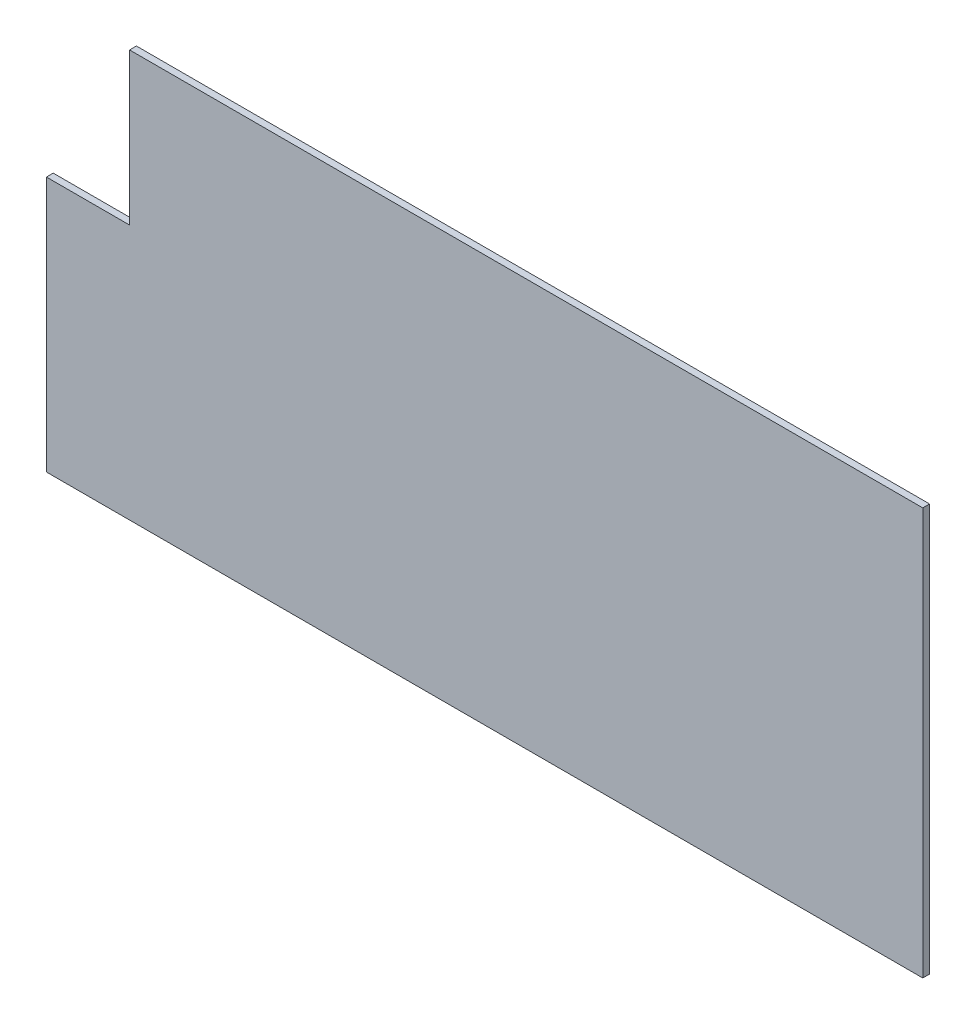
ISO-10303-21;
HEADER;
FILE_DESCRIPTION(('STEP AP214'),'2;1');
FILE_NAME('part.step','',(''),(''),'','','');
FILE_SCHEMA(('AUTOMOTIVE_DESIGN { 1 0 10303 214 1 1 1 1 }'));
ENDSEC;
DATA;
#1=APPLICATION_CONTEXT('core data for automotive mechanical design processes');
#2=APPLICATION_PROTOCOL_DEFINITION('international standard','automotive_design',2000,#1);
#3=PRODUCT_CONTEXT('',#1,'mechanical');
#4=PRODUCT('Part','Part','',(#3));
#5=PRODUCT_RELATED_PRODUCT_CATEGORY('part','',(#4));
#6=PRODUCT_DEFINITION_FORMATION('','',#4);
#7=PRODUCT_DEFINITION_CONTEXT('part definition',#1,'design');
#8=PRODUCT_DEFINITION('design','',#6,#7);
#9=PRODUCT_DEFINITION_SHAPE('','',#8);
#10=(LENGTH_UNIT() NAMED_UNIT(*) SI_UNIT(.MILLI.,.METRE.));
#11=(NAMED_UNIT(*) PLANE_ANGLE_UNIT() SI_UNIT($,.RADIAN.));
#12=(NAMED_UNIT(*) SI_UNIT($,.STERADIAN.) SOLID_ANGLE_UNIT());
#13=UNCERTAINTY_MEASURE_WITH_UNIT(LENGTH_MEASURE(1.E-05),#10,'distance_accuracy_value','');
#14=(GEOMETRIC_REPRESENTATION_CONTEXT(3) GLOBAL_UNCERTAINTY_ASSIGNED_CONTEXT((#13)) GLOBAL_UNIT_ASSIGNED_CONTEXT((#10,
#11,#12)) REPRESENTATION_CONTEXT('',''));
#15=CARTESIAN_POINT('',(0.,0.,0.));
#16=DIRECTION('',(0.,0.,1.));
#17=DIRECTION('',(1.,0.,0.));
#18=AXIS2_PLACEMENT_3D('',#15,#16,#17);
#19=CARTESIAN_POINT('',(289.5,-134.5,2.2479));
#20=DIRECTION('',(-1.,0.,0.));
#21=DIRECTION('',(0.,0.,1.));
#22=AXIS2_PLACEMENT_3D('',#19,#20,#21);
#23=PLANE('',#22);
#24=DIRECTION('',(0.,1.,0.));
#25=VECTOR('',#24,1.);
#26=CARTESIAN_POINT('',(289.5,-134.5,-2.2479));
#27=LINE('',#26,#25);
#28=CARTESIAN_POINT('',(289.5,-134.5,-2.2479));
#29=VERTEX_POINT('',#28);
#30=CARTESIAN_POINT('',(289.5,134.5,-2.2479));
#31=VERTEX_POINT('',#30);
#32=EDGE_CURVE('E119',#29,#31,#27,.T.);
#33=ORIENTED_EDGE('',*,*,#32,.T.);
#34=DIRECTION('',(0.,0.,-1.));
#35=VECTOR('',#34,1.);
#36=CARTESIAN_POINT('',(289.5,134.5,2.2479));
#37=LINE('',#36,#35);
#38=CARTESIAN_POINT('',(289.5,134.5,2.2479));
#39=VERTEX_POINT('',#38);
#40=EDGE_CURVE('E11',#39,#31,#37,.T.);
#41=ORIENTED_EDGE('',*,*,#40,.F.);
#42=DIRECTION('',(0.,1.,0.));
#43=VECTOR('',#42,1.);
#44=CARTESIAN_POINT('',(289.5,-134.5,2.2479));
#45=LINE('',#44,#43);
#46=CARTESIAN_POINT('',(289.5,-134.5,2.2479));
#47=VERTEX_POINT('',#46);
#48=EDGE_CURVE('E120',#47,#39,#45,.T.);
#49=ORIENTED_EDGE('',*,*,#48,.F.);
#50=DIRECTION('',(0.,0.,-1.));
#51=VECTOR('',#50,1.);
#52=CARTESIAN_POINT('',(289.5,-134.5,2.2479));
#53=LINE('',#52,#51);
#54=EDGE_CURVE('E126',#47,#29,#53,.T.);
#55=ORIENTED_EDGE('',*,*,#54,.T.);
#56=EDGE_LOOP('',(#33,#41,#49,#55));
#57=FACE_BOUND('',#56,.T.);
#58=ADVANCED_FACE('F33',(#57),#23,.F.);
#59=CARTESIAN_POINT('',(-289.5,134.5,2.2479));
#60=DIRECTION('',(0.,-1.,0.));
#61=DIRECTION('',(0.,0.,-1.));
#62=AXIS2_PLACEMENT_3D('',#59,#60,#61);
#63=PLANE('',#62);
#64=DIRECTION('',(-1.,0.,0.));
#65=VECTOR('',#64,1.);
#66=CARTESIAN_POINT('',(-289.5,134.5,-2.2479));
#67=LINE('',#66,#65);
#68=CARTESIAN_POINT('',(-234.550006437455,134.5,-2.2479));
#69=VERTEX_POINT('',#68);
#70=EDGE_CURVE('E129',#31,#69,#67,.T.);
#71=ORIENTED_EDGE('',*,*,#70,.T.);
#72=DIRECTION('',(0.,0.,-1.));
#73=VECTOR('',#72,1.);
#74=CARTESIAN_POINT('',(-234.550006437455,134.5,116.526252248025));
#75=LINE('',#74,#73);
#76=CARTESIAN_POINT('',(-234.550006437455,134.5,2.2479));
#77=VERTEX_POINT('',#76);
#78=EDGE_CURVE('E47',#77,#69,#75,.T.);
#79=ORIENTED_EDGE('',*,*,#78,.F.);
#80=DIRECTION('',(-1.,0.,0.));
#81=VECTOR('',#80,1.);
#82=CARTESIAN_POINT('',(-289.5,134.5,2.2479));
#83=LINE('',#82,#81);
#84=EDGE_CURVE('E78',#39,#77,#83,.T.);
#85=ORIENTED_EDGE('',*,*,#84,.F.);
#86=ORIENTED_EDGE('',*,*,#40,.T.);
#87=EDGE_LOOP('',(#71,#79,#85,#86));
#88=FACE_BOUND('',#87,.T.);
#89=ADVANCED_FACE('F142',(#88),#63,.F.);
#90=CARTESIAN_POINT('',(-289.5,-134.5,2.2479));
#91=DIRECTION('',(1.,0.,0.));
#92=DIRECTION('',(0.,0.,-1.));
#93=AXIS2_PLACEMENT_3D('',#90,#91,#92);
#94=PLANE('',#93);
#95=DIRECTION('',(0.,-1.,0.));
#96=VECTOR('',#95,1.);
#97=CARTESIAN_POINT('',(-289.5,-134.5,2.2479));
#98=LINE('',#97,#96);
#99=CARTESIAN_POINT('',(-289.5,34.2999999999998,2.2479));
#100=VERTEX_POINT('',#99);
#101=CARTESIAN_POINT('',(-289.5,-134.5,2.2479));
#102=VERTEX_POINT('',#101);
#103=EDGE_CURVE('E123',#100,#102,#98,.T.);
#104=ORIENTED_EDGE('',*,*,#103,.F.);
#105=DIRECTION('',(0.,0.,-1.));
#106=VECTOR('',#105,1.);
#107=CARTESIAN_POINT('',(-289.5,34.2999999999998,116.526252248025));
#108=LINE('',#107,#106);
#109=CARTESIAN_POINT('',(-289.5,34.2999999999998,-2.2479));
#110=VERTEX_POINT('',#109);
#111=EDGE_CURVE('E102',#100,#110,#108,.T.);
#112=ORIENTED_EDGE('',*,*,#111,.T.);
#113=DIRECTION('',(0.,-1.,0.));
#114=VECTOR('',#113,1.);
#115=CARTESIAN_POINT('',(-289.5,-134.5,-2.2479));
#116=LINE('',#115,#114);
#117=CARTESIAN_POINT('',(-289.5,-134.5,-2.2479));
#118=VERTEX_POINT('',#117);
#119=EDGE_CURVE('E111',#110,#118,#116,.T.);
#120=ORIENTED_EDGE('',*,*,#119,.T.);
#121=DIRECTION('',(0.,0.,-1.));
#122=VECTOR('',#121,1.);
#123=CARTESIAN_POINT('',(-289.5,-134.5,2.2479));
#124=LINE('',#123,#122);
#125=EDGE_CURVE('E40',#102,#118,#124,.T.);
#126=ORIENTED_EDGE('',*,*,#125,.F.);
#127=EDGE_LOOP('',(#104,#112,#120,#126));
#128=FACE_BOUND('',#127,.T.);
#129=ADVANCED_FACE('F144',(#128),#94,.F.);
#130=CARTESIAN_POINT('',(-289.5,-134.5,2.2479));
#131=DIRECTION('',(0.,1.,0.));
#132=DIRECTION('',(0.,0.,1.));
#133=AXIS2_PLACEMENT_3D('',#130,#131,#132);
#134=PLANE('',#133);
#135=DIRECTION('',(1.,0.,0.));
#136=VECTOR('',#135,1.);
#137=CARTESIAN_POINT('',(-289.5,-134.5,-2.2479));
#138=LINE('',#137,#136);
#139=EDGE_CURVE('E73',#118,#29,#138,.T.);
#140=ORIENTED_EDGE('',*,*,#139,.T.);
#141=ORIENTED_EDGE('',*,*,#54,.F.);
#142=DIRECTION('',(1.,0.,0.));
#143=VECTOR('',#142,1.);
#144=CARTESIAN_POINT('',(-289.5,-134.5,2.2479));
#145=LINE('',#144,#143);
#146=EDGE_CURVE('E56',#102,#47,#145,.T.);
#147=ORIENTED_EDGE('',*,*,#146,.F.);
#148=ORIENTED_EDGE('',*,*,#125,.T.);
#149=EDGE_LOOP('',(#140,#141,#147,#148));
#150=FACE_BOUND('',#149,.T.);
#151=ADVANCED_FACE('F134',(#150),#134,.F.);
#152=CARTESIAN_POINT('',(0.,0.,2.2479));
#153=DIRECTION('',(0.,0.,-1.));
#154=DIRECTION('',(-1.,0.,0.));
#155=AXIS2_PLACEMENT_3D('',#152,#153,#154);
#156=PLANE('',#155);
#157=DIRECTION('',(0.,1.,0.));
#158=VECTOR('',#157,1.);
#159=CARTESIAN_POINT('',(-234.550006437455,34.2999999999998,2.2479));
#160=LINE('',#159,#158);
#161=CARTESIAN_POINT('',(-234.550006437455,34.2999999999998,2.2479));
#162=VERTEX_POINT('',#161);
#163=EDGE_CURVE('E117',#162,#77,#160,.T.);
#164=ORIENTED_EDGE('',*,*,#163,.F.);
#165=DIRECTION('',(1.,0.,0.));
#166=VECTOR('',#165,1.);
#167=CARTESIAN_POINT('',(-234.550006437455,34.2999999999998,2.2479));
#168=LINE('',#167,#166);
#169=EDGE_CURVE('E100',#100,#162,#168,.T.);
#170=ORIENTED_EDGE('',*,*,#169,.F.);
#171=ORIENTED_EDGE('',*,*,#103,.T.);
#172=ORIENTED_EDGE('',*,*,#146,.T.);
#173=ORIENTED_EDGE('',*,*,#48,.T.);
#174=ORIENTED_EDGE('',*,*,#84,.T.);
#175=EDGE_LOOP('',(#164,#170,#171,#172,#173,#174));
#176=FACE_BOUND('',#175,.T.);
#177=ADVANCED_FACE('F141',(#176),#156,.F.);
#178=CARTESIAN_POINT('',(0.,0.,-2.2479));
#179=DIRECTION('',(0.,0.,-1.));
#180=DIRECTION('',(-1.,0.,0.));
#181=AXIS2_PLACEMENT_3D('',#178,#179,#180);
#182=PLANE('',#181);
#183=DIRECTION('',(-1.,0.,0.));
#184=VECTOR('',#183,1.);
#185=CARTESIAN_POINT('',(-234.550006437455,34.2999999999998,-2.2479));
#186=LINE('',#185,#184);
#187=CARTESIAN_POINT('',(-234.550006437455,34.2999999999998,-2.2479));
#188=VERTEX_POINT('',#187);
#189=EDGE_CURVE('E97',#188,#110,#186,.T.);
#190=ORIENTED_EDGE('',*,*,#189,.F.);
#191=DIRECTION('',(0.,-1.,0.));
#192=VECTOR('',#191,1.);
#193=CARTESIAN_POINT('',(-234.550006437455,34.2999999999998,-2.2479));
#194=LINE('',#193,#192);
#195=EDGE_CURVE('E104',#69,#188,#194,.T.);
#196=ORIENTED_EDGE('',*,*,#195,.F.);
#197=ORIENTED_EDGE('',*,*,#70,.F.);
#198=ORIENTED_EDGE('',*,*,#32,.F.);
#199=ORIENTED_EDGE('',*,*,#139,.F.);
#200=ORIENTED_EDGE('',*,*,#119,.F.);
#201=EDGE_LOOP('',(#190,#196,#197,#198,#199,#200));
#202=FACE_BOUND('',#201,.T.);
#203=ADVANCED_FACE('F110',(#202),#182,.T.);
#204=CARTESIAN_POINT('',(-234.550006437455,34.2999999999998,116.526252248025));
#205=DIRECTION('',(0.,-1.,0.));
#206=DIRECTION('',(1.,0.,0.));
#207=AXIS2_PLACEMENT_3D('',#204,#205,#206);
#208=PLANE('',#207);
#209=ORIENTED_EDGE('',*,*,#169,.T.);
#210=DIRECTION('',(0.,0.,-1.));
#211=VECTOR('',#210,1.);
#212=CARTESIAN_POINT('',(-234.550006437455,34.2999999999998,116.526252248025));
#213=LINE('',#212,#211);
#214=EDGE_CURVE('E94',#162,#188,#213,.T.);
#215=ORIENTED_EDGE('',*,*,#214,.T.);
#216=ORIENTED_EDGE('',*,*,#189,.T.);
#217=ORIENTED_EDGE('',*,*,#111,.F.);
#218=EDGE_LOOP('',(#209,#215,#216,#217));
#219=FACE_BOUND('',#218,.T.);
#220=ADVANCED_FACE('F95',(#219),#208,.F.);
#221=CARTESIAN_POINT('',(-234.550006437455,34.2999999999998,116.526252248025));
#222=DIRECTION('',(1.,0.,0.));
#223=DIRECTION('',(0.,0.,-1.));
#224=AXIS2_PLACEMENT_3D('',#221,#222,#223);
#225=PLANE('',#224);
#226=ORIENTED_EDGE('',*,*,#163,.T.);
#227=ORIENTED_EDGE('',*,*,#78,.T.);
#228=ORIENTED_EDGE('',*,*,#195,.T.);
#229=ORIENTED_EDGE('',*,*,#214,.F.);
#230=EDGE_LOOP('',(#226,#227,#228,#229));
#231=FACE_BOUND('',#230,.T.);
#232=ADVANCED_FACE('F105',(#231),#225,.F.);
#233=CLOSED_SHELL('',(#58,#89,#129,#151,#177,#203,#220,#232));
#234=MANIFOLD_SOLID_BREP('B2',#233);
#235=ADVANCED_BREP_SHAPE_REPRESENTATION('',(#18,#234),#14);
#236=SHAPE_DEFINITION_REPRESENTATION(#9,#235);
ENDSEC;
END-ISO-10303-21;
